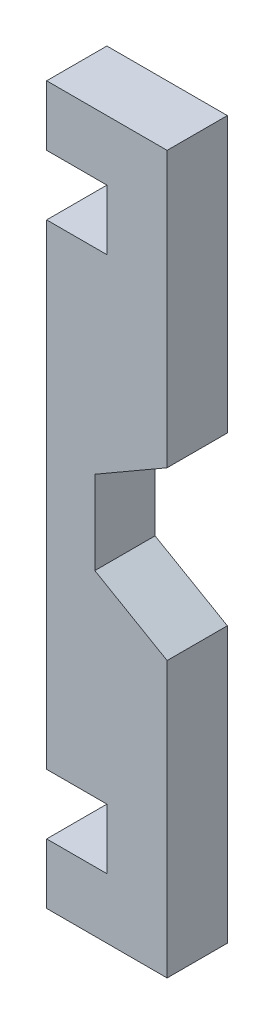
ISO-10303-21;
HEADER;
FILE_DESCRIPTION(('STEP AP214'),'2;1');
FILE_NAME('part.step','',(''),(''),'','','');
FILE_SCHEMA(('AUTOMOTIVE_DESIGN { 1 0 10303 214 1 1 1 1 }'));
ENDSEC;
DATA;
#1=APPLICATION_CONTEXT('core data for automotive mechanical design processes');
#2=APPLICATION_PROTOCOL_DEFINITION('international standard','automotive_design',2000,#1);
#3=PRODUCT_CONTEXT('',#1,'mechanical');
#4=PRODUCT('Part','Part','',(#3));
#5=PRODUCT_RELATED_PRODUCT_CATEGORY('part','',(#4));
#6=PRODUCT_DEFINITION_FORMATION('','',#4);
#7=PRODUCT_DEFINITION_CONTEXT('part definition',#1,'design');
#8=PRODUCT_DEFINITION('design','',#6,#7);
#9=PRODUCT_DEFINITION_SHAPE('','',#8);
#10=(LENGTH_UNIT() NAMED_UNIT(*) SI_UNIT(.MILLI.,.METRE.));
#11=(NAMED_UNIT(*) PLANE_ANGLE_UNIT() SI_UNIT($,.RADIAN.));
#12=(NAMED_UNIT(*) SI_UNIT($,.STERADIAN.) SOLID_ANGLE_UNIT());
#13=UNCERTAINTY_MEASURE_WITH_UNIT(LENGTH_MEASURE(1.E-05),#10,'distance_accuracy_value','');
#14=(GEOMETRIC_REPRESENTATION_CONTEXT(3) GLOBAL_UNCERTAINTY_ASSIGNED_CONTEXT((#13)) GLOBAL_UNIT_ASSIGNED_CONTEXT((#10,
#11,#12)) REPRESENTATION_CONTEXT('',''));
#15=CARTESIAN_POINT('',(0.,0.,0.));
#16=DIRECTION('',(0.,0.,1.));
#17=DIRECTION('',(1.,0.,0.));
#18=AXIS2_PLACEMENT_3D('',#15,#16,#17);
#19=CARTESIAN_POINT('',(-11.5520008623713,-20.0086524227066,5.));
#20=DIRECTION('',(0.5,0.866025403784439,0.));
#21=DIRECTION('',(-0.866025403784439,0.5,0.));
#22=AXIS2_PLACEMENT_3D('',#19,#20,#21);
#23=PLANE('',#22);
#24=DIRECTION('',(0.866025403784439,-0.5,0.));
#25=VECTOR('',#24,1.);
#26=CARTESIAN_POINT('',(-11.5520008623713,-20.0086524227066,0.));
#27=LINE('',#26,#25);
#28=CARTESIAN_POINT('',(-6.,-23.2141016151377,0.));
#29=VERTEX_POINT('',#28);
#30=CARTESIAN_POINT('',(0.,-26.6782032302755,0.));
#31=VERTEX_POINT('',#30);
#32=EDGE_CURVE('E282',#29,#31,#27,.T.);
#33=ORIENTED_EDGE('',*,*,#32,.F.);
#34=DIRECTION('',(0.,0.,-1.));
#35=VECTOR('',#34,1.);
#36=CARTESIAN_POINT('',(-6.,-23.2141016151377,5.));
#37=LINE('',#36,#35);
#38=CARTESIAN_POINT('',(-6.,-23.2141016151377,5.));
#39=VERTEX_POINT('',#38);
#40=EDGE_CURVE('E12',#39,#29,#37,.T.);
#41=ORIENTED_EDGE('',*,*,#40,.F.);
#42=DIRECTION('',(0.866025403784439,-0.5,0.));
#43=VECTOR('',#42,1.);
#44=CARTESIAN_POINT('',(-11.5520008623713,-20.0086524227066,5.));
#45=LINE('',#44,#43);
#46=CARTESIAN_POINT('',(0.,-26.6782032302755,5.));
#47=VERTEX_POINT('',#46);
#48=EDGE_CURVE('E234',#39,#47,#45,.T.);
#49=ORIENTED_EDGE('',*,*,#48,.T.);
#50=DIRECTION('',(0.,0.,-1.));
#51=VECTOR('',#50,1.);
#52=CARTESIAN_POINT('',(0.,-26.6782032302755,5.));
#53=LINE('',#52,#51);
#54=EDGE_CURVE('E53',#47,#31,#53,.T.);
#55=ORIENTED_EDGE('',*,*,#54,.T.);
#56=EDGE_LOOP('',(#33,#41,#49,#55));
#57=FACE_BOUND('',#56,.T.);
#58=ADVANCED_FACE('F37',(#57),#23,.T.);
#59=CARTESIAN_POINT('',(-6.,0.,5.));
#60=DIRECTION('',(1.,0.,0.));
#61=DIRECTION('',(0.,0.,-1.));
#62=AXIS2_PLACEMENT_3D('',#59,#60,#61);
#63=PLANE('',#62);
#64=DIRECTION('',(0.,-1.,0.));
#65=VECTOR('',#64,1.);
#66=CARTESIAN_POINT('',(-6.,0.,0.));
#67=LINE('',#66,#65);
#68=CARTESIAN_POINT('',(-6.,-16.2858983848622,0.));
#69=VERTEX_POINT('',#68);
#70=EDGE_CURVE('E280',#69,#29,#67,.T.);
#71=ORIENTED_EDGE('',*,*,#70,.F.);
#72=DIRECTION('',(0.,0.,-1.));
#73=VECTOR('',#72,1.);
#74=CARTESIAN_POINT('',(-6.,-16.2858983848622,5.));
#75=LINE('',#74,#73);
#76=CARTESIAN_POINT('',(-6.,-16.2858983848622,5.));
#77=VERTEX_POINT('',#76);
#78=EDGE_CURVE('E45',#77,#69,#75,.T.);
#79=ORIENTED_EDGE('',*,*,#78,.F.);
#80=DIRECTION('',(0.,-1.,0.));
#81=VECTOR('',#80,1.);
#82=CARTESIAN_POINT('',(-6.,0.,5.));
#83=LINE('',#82,#81);
#84=EDGE_CURVE('E229',#77,#39,#83,.T.);
#85=ORIENTED_EDGE('',*,*,#84,.T.);
#86=ORIENTED_EDGE('',*,*,#40,.T.);
#87=EDGE_LOOP('',(#71,#79,#85,#86));
#88=FACE_BOUND('',#87,.T.);
#89=ADVANCED_FACE('F281',(#88),#63,.T.);
#90=CARTESIAN_POINT('',(5.55200086237133,-9.61634757729337,5.));
#91=DIRECTION('',(0.5,-0.866025403784439,0.));
#92=DIRECTION('',(0.866025403784439,0.5,0.));
#93=AXIS2_PLACEMENT_3D('',#90,#91,#92);
#94=PLANE('',#93);
#95=DIRECTION('',(-0.866025403784439,-0.5,0.));
#96=VECTOR('',#95,1.);
#97=CARTESIAN_POINT('',(5.55200086237133,-9.61634757729337,0.));
#98=LINE('',#97,#96);
#99=CARTESIAN_POINT('',(0.,-12.8217967697245,0.));
#100=VERTEX_POINT('',#99);
#101=EDGE_CURVE('E274',#100,#69,#98,.T.);
#102=ORIENTED_EDGE('',*,*,#101,.F.);
#103=DIRECTION('',(0.,0.,-1.));
#104=VECTOR('',#103,1.);
#105=CARTESIAN_POINT('',(0.,-12.8217967697245,5.));
#106=LINE('',#105,#104);
#107=CARTESIAN_POINT('',(0.,-12.8217967697245,5.));
#108=VERTEX_POINT('',#107);
#109=EDGE_CURVE('E268',#108,#100,#106,.T.);
#110=ORIENTED_EDGE('',*,*,#109,.F.);
#111=DIRECTION('',(-0.866025403784439,-0.5,0.));
#112=VECTOR('',#111,1.);
#113=CARTESIAN_POINT('',(5.55200086237133,-9.61634757729337,5.));
#114=LINE('',#113,#112);
#115=EDGE_CURVE('E225',#108,#77,#114,.T.);
#116=ORIENTED_EDGE('',*,*,#115,.T.);
#117=ORIENTED_EDGE('',*,*,#78,.T.);
#118=EDGE_LOOP('',(#102,#110,#116,#117));
#119=FACE_BOUND('',#118,.T.);
#120=ADVANCED_FACE('F272',(#119),#94,.T.);
#121=CARTESIAN_POINT('',(0.,0.,5.));
#122=DIRECTION('',(1.,0.,0.));
#123=DIRECTION('',(0.,1.,0.));
#124=AXIS2_PLACEMENT_3D('',#121,#122,#123);
#125=PLANE('',#124);
#126=DIRECTION('',(0.,-1.,0.));
#127=VECTOR('',#126,1.);
#128=CARTESIAN_POINT('',(0.,0.,0.));
#129=LINE('',#128,#127);
#130=CARTESIAN_POINT('',(0.,10.,0.));
#131=VERTEX_POINT('',#130);
#132=EDGE_CURVE('E287',#131,#100,#129,.T.);
#133=ORIENTED_EDGE('',*,*,#132,.F.);
#134=DIRECTION('',(0.,0.,-1.));
#135=VECTOR('',#134,1.);
#136=CARTESIAN_POINT('',(0.,10.,5.));
#137=LINE('',#136,#135);
#138=CARTESIAN_POINT('',(0.,10.,5.));
#139=VERTEX_POINT('',#138);
#140=EDGE_CURVE('E266',#139,#131,#137,.T.);
#141=ORIENTED_EDGE('',*,*,#140,.F.);
#142=DIRECTION('',(0.,-1.,0.));
#143=VECTOR('',#142,1.);
#144=CARTESIAN_POINT('',(0.,0.,5.));
#145=LINE('',#144,#143);
#146=EDGE_CURVE('E221',#139,#108,#145,.T.);
#147=ORIENTED_EDGE('',*,*,#146,.T.);
#148=ORIENTED_EDGE('',*,*,#109,.T.);
#149=EDGE_LOOP('',(#133,#141,#147,#148));
#150=FACE_BOUND('',#149,.T.);
#151=ADVANCED_FACE('F355',(#150),#125,.T.);
#152=CARTESIAN_POINT('',(0.,10.,5.));
#153=DIRECTION('',(0.,1.,0.));
#154=DIRECTION('',(0.,0.,1.));
#155=AXIS2_PLACEMENT_3D('',#152,#153,#154);
#156=PLANE('',#155);
#157=DIRECTION('',(1.,0.,0.));
#158=VECTOR('',#157,1.);
#159=CARTESIAN_POINT('',(0.,10.,0.));
#160=LINE('',#159,#158);
#161=CARTESIAN_POINT('',(-10.,10.,0.));
#162=VERTEX_POINT('',#161);
#163=EDGE_CURVE('E289',#162,#131,#160,.T.);
#164=ORIENTED_EDGE('',*,*,#163,.F.);
#165=DIRECTION('',(0.,0.,-1.));
#166=VECTOR('',#165,1.);
#167=CARTESIAN_POINT('',(-10.,10.,5.));
#168=LINE('',#167,#166);
#169=CARTESIAN_POINT('',(-10.,10.,5.));
#170=VERTEX_POINT('',#169);
#171=EDGE_CURVE('E264',#170,#162,#168,.T.);
#172=ORIENTED_EDGE('',*,*,#171,.F.);
#173=DIRECTION('',(1.,0.,0.));
#174=VECTOR('',#173,1.);
#175=CARTESIAN_POINT('',(0.,10.,5.));
#176=LINE('',#175,#174);
#177=EDGE_CURVE('E218',#170,#139,#176,.T.);
#178=ORIENTED_EDGE('',*,*,#177,.T.);
#179=ORIENTED_EDGE('',*,*,#140,.T.);
#180=EDGE_LOOP('',(#164,#172,#178,#179));
#181=FACE_BOUND('',#180,.T.);
#182=ADVANCED_FACE('F352',(#181),#156,.T.);
#183=CARTESIAN_POINT('',(-9.99999999999999,0.,5.));
#184=DIRECTION('',(1.,0.,0.));
#185=DIRECTION('',(0.,1.,0.));
#186=AXIS2_PLACEMENT_3D('',#183,#184,#185);
#187=PLANE('',#186);
#188=DIRECTION('',(0.,-1.,0.));
#189=VECTOR('',#188,1.);
#190=CARTESIAN_POINT('',(-9.99999999999999,0.,0.));
#191=LINE('',#190,#189);
#192=CARTESIAN_POINT('',(-10.,5.,0.));
#193=VERTEX_POINT('',#192);
#194=EDGE_CURVE('E293',#162,#193,#191,.T.);
#195=ORIENTED_EDGE('',*,*,#194,.T.);
#196=DIRECTION('',(0.,0.,-1.));
#197=VECTOR('',#196,1.);
#198=CARTESIAN_POINT('',(-10.,5.,5.));
#199=LINE('',#198,#197);
#200=CARTESIAN_POINT('',(-10.,5.,5.));
#201=VERTEX_POINT('',#200);
#202=EDGE_CURVE('E262',#201,#193,#199,.T.);
#203=ORIENTED_EDGE('',*,*,#202,.F.);
#204=DIRECTION('',(0.,-1.,0.));
#205=VECTOR('',#204,1.);
#206=CARTESIAN_POINT('',(-9.99999999999999,0.,5.));
#207=LINE('',#206,#205);
#208=EDGE_CURVE('E210',#170,#201,#207,.T.);
#209=ORIENTED_EDGE('',*,*,#208,.F.);
#210=ORIENTED_EDGE('',*,*,#171,.T.);
#211=EDGE_LOOP('',(#195,#203,#209,#210));
#212=FACE_BOUND('',#211,.T.);
#213=ADVANCED_FACE('F349',(#212),#187,.F.);
#214=CARTESIAN_POINT('',(0.,5.,5.));
#215=DIRECTION('',(0.,-1.,0.));
#216=DIRECTION('',(1.,0.,0.));
#217=AXIS2_PLACEMENT_3D('',#214,#215,#216);
#218=PLANE('',#217);
#219=DIRECTION('',(-1.,0.,0.));
#220=VECTOR('',#219,1.);
#221=CARTESIAN_POINT('',(0.,5.,0.));
#222=LINE('',#221,#220);
#223=CARTESIAN_POINT('',(-5.,5.,0.));
#224=VERTEX_POINT('',#223);
#225=EDGE_CURVE('E296',#224,#193,#222,.T.);
#226=ORIENTED_EDGE('',*,*,#225,.F.);
#227=DIRECTION('',(0.,0.,-1.));
#228=VECTOR('',#227,1.);
#229=CARTESIAN_POINT('',(-5.,5.,5.));
#230=LINE('',#229,#228);
#231=CARTESIAN_POINT('',(-5.,5.,5.));
#232=VERTEX_POINT('',#231);
#233=EDGE_CURVE('E260',#232,#224,#230,.T.);
#234=ORIENTED_EDGE('',*,*,#233,.F.);
#235=DIRECTION('',(-1.,0.,0.));
#236=VECTOR('',#235,1.);
#237=CARTESIAN_POINT('',(0.,5.,5.));
#238=LINE('',#237,#236);
#239=EDGE_CURVE('E206',#232,#201,#238,.T.);
#240=ORIENTED_EDGE('',*,*,#239,.T.);
#241=ORIENTED_EDGE('',*,*,#202,.T.);
#242=EDGE_LOOP('',(#226,#234,#240,#241));
#243=FACE_BOUND('',#242,.T.);
#244=ADVANCED_FACE('F344',(#243),#218,.T.);
#245=CARTESIAN_POINT('',(-5.,0.,5.));
#246=DIRECTION('',(-1.,0.,0.));
#247=DIRECTION('',(0.,0.,1.));
#248=AXIS2_PLACEMENT_3D('',#245,#246,#247);
#249=PLANE('',#248);
#250=DIRECTION('',(0.,1.,0.));
#251=VECTOR('',#250,1.);
#252=CARTESIAN_POINT('',(-5.,0.,0.));
#253=LINE('',#252,#251);
#254=CARTESIAN_POINT('',(-5.,0.,0.));
#255=VERTEX_POINT('',#254);
#256=EDGE_CURVE('E299',#255,#224,#253,.T.);
#257=ORIENTED_EDGE('',*,*,#256,.F.);
#258=DIRECTION('',(0.,0.,-1.));
#259=VECTOR('',#258,1.);
#260=CARTESIAN_POINT('',(-5.,0.,5.));
#261=LINE('',#260,#259);
#262=CARTESIAN_POINT('',(-5.,0.,5.));
#263=VERTEX_POINT('',#262);
#264=EDGE_CURVE('E258',#263,#255,#261,.T.);
#265=ORIENTED_EDGE('',*,*,#264,.F.);
#266=DIRECTION('',(0.,1.,0.));
#267=VECTOR('',#266,1.);
#268=CARTESIAN_POINT('',(-5.,0.,5.));
#269=LINE('',#268,#267);
#270=EDGE_CURVE('E202',#263,#232,#269,.T.);
#271=ORIENTED_EDGE('',*,*,#270,.T.);
#272=ORIENTED_EDGE('',*,*,#233,.T.);
#273=EDGE_LOOP('',(#257,#265,#271,#272));
#274=FACE_BOUND('',#273,.T.);
#275=ADVANCED_FACE('F339',(#274),#249,.T.);
#276=CARTESIAN_POINT('',(0.,0.,5.));
#277=DIRECTION('',(0.,-1.,0.));
#278=DIRECTION('',(0.,0.,-1.));
#279=AXIS2_PLACEMENT_3D('',#276,#277,#278);
#280=PLANE('',#279);
#281=DIRECTION('',(-1.,0.,0.));
#282=VECTOR('',#281,1.);
#283=CARTESIAN_POINT('',(0.,0.,0.));
#284=LINE('',#283,#282);
#285=CARTESIAN_POINT('',(-10.,0.,0.));
#286=VERTEX_POINT('',#285);
#287=EDGE_CURVE('E302',#255,#286,#284,.T.);
#288=ORIENTED_EDGE('',*,*,#287,.T.);
#289=DIRECTION('',(0.,0.,-1.));
#290=VECTOR('',#289,1.);
#291=CARTESIAN_POINT('',(-10.,0.,5.));
#292=LINE('',#291,#290);
#293=CARTESIAN_POINT('',(-10.,0.,5.));
#294=VERTEX_POINT('',#293);
#295=EDGE_CURVE('E255',#294,#286,#292,.T.);
#296=ORIENTED_EDGE('',*,*,#295,.F.);
#297=DIRECTION('',(-1.,0.,0.));
#298=VECTOR('',#297,1.);
#299=CARTESIAN_POINT('',(0.,0.,5.));
#300=LINE('',#299,#298);
#301=EDGE_CURVE('E200',#263,#294,#300,.T.);
#302=ORIENTED_EDGE('',*,*,#301,.F.);
#303=ORIENTED_EDGE('',*,*,#264,.T.);
#304=EDGE_LOOP('',(#288,#296,#302,#303));
#305=FACE_BOUND('',#304,.T.);
#306=ADVANCED_FACE('F336',(#305),#280,.F.);
#307=CARTESIAN_POINT('',(-10.,0.,5.));
#308=DIRECTION('',(1.,0.,0.));
#309=DIRECTION('',(0.,1.,0.));
#310=AXIS2_PLACEMENT_3D('',#307,#308,#309);
#311=PLANE('',#310);
#312=DIRECTION('',(0.,-1.,0.));
#313=VECTOR('',#312,1.);
#314=CARTESIAN_POINT('',(-10.,0.,0.));
#315=LINE('',#314,#313);
#316=CARTESIAN_POINT('',(-10.,-39.5,0.));
#317=VERTEX_POINT('',#316);
#318=EDGE_CURVE('E304',#286,#317,#315,.T.);
#319=ORIENTED_EDGE('',*,*,#318,.T.);
#320=DIRECTION('',(0.,0.,-1.));
#321=VECTOR('',#320,1.);
#322=CARTESIAN_POINT('',(-10.,-39.5,5.));
#323=LINE('',#322,#321);
#324=CARTESIAN_POINT('',(-10.,-39.5,5.));
#325=VERTEX_POINT('',#324);
#326=EDGE_CURVE('E253',#325,#317,#323,.T.);
#327=ORIENTED_EDGE('',*,*,#326,.F.);
#328=DIRECTION('',(0.,-1.,0.));
#329=VECTOR('',#328,1.);
#330=CARTESIAN_POINT('',(-10.,0.,5.));
#331=LINE('',#330,#329);
#332=EDGE_CURVE('E192',#294,#325,#331,.T.);
#333=ORIENTED_EDGE('',*,*,#332,.F.);
#334=ORIENTED_EDGE('',*,*,#295,.T.);
#335=EDGE_LOOP('',(#319,#327,#333,#334));
#336=FACE_BOUND('',#335,.T.);
#337=ADVANCED_FACE('F331',(#336),#311,.F.);
#338=CARTESIAN_POINT('',(0.,-39.5,5.));
#339=DIRECTION('',(0.,-1.,0.));
#340=DIRECTION('',(0.,0.,-1.));
#341=AXIS2_PLACEMENT_3D('',#338,#339,#340);
#342=PLANE('',#341);
#343=DIRECTION('',(-1.,0.,0.));
#344=VECTOR('',#343,1.);
#345=CARTESIAN_POINT('',(0.,-39.5,0.));
#346=LINE('',#345,#344);
#347=CARTESIAN_POINT('',(-5.,-39.5,0.));
#348=VERTEX_POINT('',#347);
#349=EDGE_CURVE('E307',#348,#317,#346,.T.);
#350=ORIENTED_EDGE('',*,*,#349,.F.);
#351=DIRECTION('',(0.,0.,-1.));
#352=VECTOR('',#351,1.);
#353=CARTESIAN_POINT('',(-5.,-39.5,5.));
#354=LINE('',#353,#352);
#355=CARTESIAN_POINT('',(-5.,-39.5,5.));
#356=VERTEX_POINT('',#355);
#357=EDGE_CURVE('E251',#356,#348,#354,.T.);
#358=ORIENTED_EDGE('',*,*,#357,.F.);
#359=DIRECTION('',(-1.,0.,0.));
#360=VECTOR('',#359,1.);
#361=CARTESIAN_POINT('',(0.,-39.5,5.));
#362=LINE('',#361,#360);
#363=EDGE_CURVE('E188',#356,#325,#362,.T.);
#364=ORIENTED_EDGE('',*,*,#363,.T.);
#365=ORIENTED_EDGE('',*,*,#326,.T.);
#366=EDGE_LOOP('',(#350,#358,#364,#365));
#367=FACE_BOUND('',#366,.T.);
#368=ADVANCED_FACE('F325',(#367),#342,.T.);
#369=CARTESIAN_POINT('',(-5.,0.,5.));
#370=DIRECTION('',(1.,0.,0.));
#371=DIRECTION('',(0.,0.,-1.));
#372=AXIS2_PLACEMENT_3D('',#369,#370,#371);
#373=PLANE('',#372);
#374=DIRECTION('',(0.,-1.,0.));
#375=VECTOR('',#374,1.);
#376=CARTESIAN_POINT('',(-5.,0.,0.));
#377=LINE('',#376,#375);
#378=CARTESIAN_POINT('',(-5.,-44.5,0.));
#379=VERTEX_POINT('',#378);
#380=EDGE_CURVE('E310',#348,#379,#377,.T.);
#381=ORIENTED_EDGE('',*,*,#380,.T.);
#382=DIRECTION('',(0.,0.,-1.));
#383=VECTOR('',#382,1.);
#384=CARTESIAN_POINT('',(-5.,-44.5,5.));
#385=LINE('',#384,#383);
#386=CARTESIAN_POINT('',(-5.,-44.5,5.));
#387=VERTEX_POINT('',#386);
#388=EDGE_CURVE('E248',#387,#379,#385,.T.);
#389=ORIENTED_EDGE('',*,*,#388,.F.);
#390=DIRECTION('',(0.,-1.,0.));
#391=VECTOR('',#390,1.);
#392=CARTESIAN_POINT('',(-5.,0.,5.));
#393=LINE('',#392,#391);
#394=EDGE_CURVE('E185',#356,#387,#393,.T.);
#395=ORIENTED_EDGE('',*,*,#394,.F.);
#396=ORIENTED_EDGE('',*,*,#357,.T.);
#397=EDGE_LOOP('',(#381,#389,#395,#396));
#398=FACE_BOUND('',#397,.T.);
#399=ADVANCED_FACE('F322',(#398),#373,.F.);
#400=CARTESIAN_POINT('',(0.,-44.5,5.));
#401=DIRECTION('',(0.,-1.,0.));
#402=DIRECTION('',(0.,0.,-1.));
#403=AXIS2_PLACEMENT_3D('',#400,#401,#402);
#404=PLANE('',#403);
#405=DIRECTION('',(-1.,0.,0.));
#406=VECTOR('',#405,1.);
#407=CARTESIAN_POINT('',(0.,-44.5,0.));
#408=LINE('',#407,#406);
#409=CARTESIAN_POINT('',(-10.,-44.5,0.));
#410=VERTEX_POINT('',#409);
#411=EDGE_CURVE('E312',#379,#410,#408,.T.);
#412=ORIENTED_EDGE('',*,*,#411,.T.);
#413=DIRECTION('',(0.,0.,-1.));
#414=VECTOR('',#413,1.);
#415=CARTESIAN_POINT('',(-10.,-44.5,5.));
#416=LINE('',#415,#414);
#417=CARTESIAN_POINT('',(-10.,-44.5,5.));
#418=VERTEX_POINT('',#417);
#419=EDGE_CURVE('E160',#418,#410,#416,.T.);
#420=ORIENTED_EDGE('',*,*,#419,.F.);
#421=DIRECTION('',(-1.,0.,0.));
#422=VECTOR('',#421,1.);
#423=CARTESIAN_POINT('',(0.,-44.5,5.));
#424=LINE('',#423,#422);
#425=EDGE_CURVE('E168',#387,#418,#424,.T.);
#426=ORIENTED_EDGE('',*,*,#425,.F.);
#427=ORIENTED_EDGE('',*,*,#388,.T.);
#428=EDGE_LOOP('',(#412,#420,#426,#427));
#429=FACE_BOUND('',#428,.T.);
#430=ADVANCED_FACE('F318',(#429),#404,.F.);
#431=CARTESIAN_POINT('',(-9.99999999999997,0.,5.));
#432=DIRECTION('',(-1.,0.,0.));
#433=DIRECTION('',(0.,-1.,0.));
#434=AXIS2_PLACEMENT_3D('',#431,#432,#433);
#435=PLANE('',#434);
#436=DIRECTION('',(0.,1.,0.));
#437=VECTOR('',#436,1.);
#438=CARTESIAN_POINT('',(-9.99999999999997,0.,0.));
#439=LINE('',#438,#437);
#440=CARTESIAN_POINT('',(-10.,-49.5,0.));
#441=VERTEX_POINT('',#440);
#442=EDGE_CURVE('E156',#441,#410,#439,.T.);
#443=ORIENTED_EDGE('',*,*,#442,.F.);
#444=DIRECTION('',(0.,0.,-1.));
#445=VECTOR('',#444,1.);
#446=CARTESIAN_POINT('',(-10.,-49.5,5.));
#447=LINE('',#446,#445);
#448=CARTESIAN_POINT('',(-10.,-49.5,5.));
#449=VERTEX_POINT('',#448);
#450=EDGE_CURVE('E151',#449,#441,#447,.T.);
#451=ORIENTED_EDGE('',*,*,#450,.F.);
#452=DIRECTION('',(0.,1.,0.));
#453=VECTOR('',#452,1.);
#454=CARTESIAN_POINT('',(-9.99999999999997,0.,5.));
#455=LINE('',#454,#453);
#456=EDGE_CURVE('E154',#449,#418,#455,.T.);
#457=ORIENTED_EDGE('',*,*,#456,.T.);
#458=ORIENTED_EDGE('',*,*,#419,.T.);
#459=EDGE_LOOP('',(#443,#451,#457,#458));
#460=FACE_BOUND('',#459,.T.);
#461=ADVANCED_FACE('F153',(#460),#435,.T.);
#462=CARTESIAN_POINT('',(0.,-49.5,5.));
#463=DIRECTION('',(0.,-1.,0.));
#464=DIRECTION('',(1.,0.,0.));
#465=AXIS2_PLACEMENT_3D('',#462,#463,#464);
#466=PLANE('',#465);
#467=DIRECTION('',(-1.,0.,0.));
#468=VECTOR('',#467,1.);
#469=CARTESIAN_POINT('',(0.,-49.5,0.));
#470=LINE('',#469,#468);
#471=CARTESIAN_POINT('',(0.,-49.5,0.));
#472=VERTEX_POINT('',#471);
#473=EDGE_CURVE('E239',#472,#441,#470,.T.);
#474=ORIENTED_EDGE('',*,*,#473,.F.);
#475=DIRECTION('',(0.,0.,-1.));
#476=VECTOR('',#475,1.);
#477=CARTESIAN_POINT('',(0.,-49.5,5.));
#478=LINE('',#477,#476);
#479=CARTESIAN_POINT('',(0.,-49.5,5.));
#480=VERTEX_POINT('',#479);
#481=EDGE_CURVE('E102',#480,#472,#478,.T.);
#482=ORIENTED_EDGE('',*,*,#481,.F.);
#483=DIRECTION('',(-1.,0.,0.));
#484=VECTOR('',#483,1.);
#485=CARTESIAN_POINT('',(0.,-49.5,5.));
#486=LINE('',#485,#484);
#487=EDGE_CURVE('E166',#480,#449,#486,.T.);
#488=ORIENTED_EDGE('',*,*,#487,.T.);
#489=ORIENTED_EDGE('',*,*,#450,.T.);
#490=EDGE_LOOP('',(#474,#482,#488,#489));
#491=FACE_BOUND('',#490,.T.);
#492=ADVANCED_FACE('F171',(#491),#466,.T.);
#493=CARTESIAN_POINT('',(0.,0.,5.));
#494=DIRECTION('',(1.,0.,0.));
#495=DIRECTION('',(0.,1.,0.));
#496=AXIS2_PLACEMENT_3D('',#493,#494,#495);
#497=PLANE('',#496);
#498=DIRECTION('',(0.,-1.,0.));
#499=VECTOR('',#498,1.);
#500=CARTESIAN_POINT('',(0.,0.,0.));
#501=LINE('',#500,#499);
#502=EDGE_CURVE('E236',#31,#472,#501,.T.);
#503=ORIENTED_EDGE('',*,*,#502,.F.);
#504=ORIENTED_EDGE('',*,*,#54,.F.);
#505=DIRECTION('',(0.,-1.,0.));
#506=VECTOR('',#505,1.);
#507=CARTESIAN_POINT('',(0.,0.,5.));
#508=LINE('',#507,#506);
#509=EDGE_CURVE('E172',#47,#480,#508,.T.);
#510=ORIENTED_EDGE('',*,*,#509,.T.);
#511=ORIENTED_EDGE('',*,*,#481,.T.);
#512=EDGE_LOOP('',(#503,#504,#510,#511));
#513=FACE_BOUND('',#512,.T.);
#514=ADVANCED_FACE('F356',(#513),#497,.T.);
#515=CARTESIAN_POINT('',(0.,0.,5.));
#516=DIRECTION('',(0.,0.,1.));
#517=DIRECTION('',(1.,0.,0.));
#518=AXIS2_PLACEMENT_3D('',#515,#516,#517);
#519=PLANE('',#518);
#520=ORIENTED_EDGE('',*,*,#48,.F.);
#521=ORIENTED_EDGE('',*,*,#84,.F.);
#522=ORIENTED_EDGE('',*,*,#115,.F.);
#523=ORIENTED_EDGE('',*,*,#146,.F.);
#524=ORIENTED_EDGE('',*,*,#177,.F.);
#525=ORIENTED_EDGE('',*,*,#208,.T.);
#526=ORIENTED_EDGE('',*,*,#239,.F.);
#527=ORIENTED_EDGE('',*,*,#270,.F.);
#528=ORIENTED_EDGE('',*,*,#301,.T.);
#529=ORIENTED_EDGE('',*,*,#332,.T.);
#530=ORIENTED_EDGE('',*,*,#363,.F.);
#531=ORIENTED_EDGE('',*,*,#394,.T.);
#532=ORIENTED_EDGE('',*,*,#425,.T.);
#533=ORIENTED_EDGE('',*,*,#456,.F.);
#534=ORIENTED_EDGE('',*,*,#487,.F.);
#535=ORIENTED_EDGE('',*,*,#509,.F.);
#536=EDGE_LOOP('',(#520,#521,#522,#523,#524,#525,#526,#527,#528,#529,#530,#531,#532,#533,#534,#535));
#537=FACE_BOUND('',#536,.T.);
#538=ADVANCED_FACE('F164',(#537),#519,.T.);
#539=CARTESIAN_POINT('',(0.,0.,0.));
#540=DIRECTION('',(0.,0.,1.));
#541=DIRECTION('',(1.,0.,0.));
#542=AXIS2_PLACEMENT_3D('',#539,#540,#541);
#543=PLANE('',#542);
#544=ORIENTED_EDGE('',*,*,#32,.T.);
#545=ORIENTED_EDGE('',*,*,#502,.T.);
#546=ORIENTED_EDGE('',*,*,#473,.T.);
#547=ORIENTED_EDGE('',*,*,#442,.T.);
#548=ORIENTED_EDGE('',*,*,#411,.F.);
#549=ORIENTED_EDGE('',*,*,#380,.F.);
#550=ORIENTED_EDGE('',*,*,#349,.T.);
#551=ORIENTED_EDGE('',*,*,#318,.F.);
#552=ORIENTED_EDGE('',*,*,#287,.F.);
#553=ORIENTED_EDGE('',*,*,#256,.T.);
#554=ORIENTED_EDGE('',*,*,#225,.T.);
#555=ORIENTED_EDGE('',*,*,#194,.F.);
#556=ORIENTED_EDGE('',*,*,#163,.T.);
#557=ORIENTED_EDGE('',*,*,#132,.T.);
#558=ORIENTED_EDGE('',*,*,#101,.T.);
#559=ORIENTED_EDGE('',*,*,#70,.T.);
#560=EDGE_LOOP('',(#544,#545,#546,#547,#548,#549,#550,#551,#552,#553,#554,#555,#556,#557,#558,#559));
#561=FACE_BOUND('',#560,.T.);
#562=ADVANCED_FACE('F284',(#561),#543,.F.);
#563=CLOSED_SHELL('',(#58,#89,#120,#151,#182,#213,#244,#275,#306,#337,#368,#399,#430,#461,#492,
#514,#538,#562));
#564=MANIFOLD_SOLID_BREP('B2',#563);
#565=ADVANCED_BREP_SHAPE_REPRESENTATION('',(#18,#564),#14);
#566=SHAPE_DEFINITION_REPRESENTATION(#9,#565);
ENDSEC;
END-ISO-10303-21;
